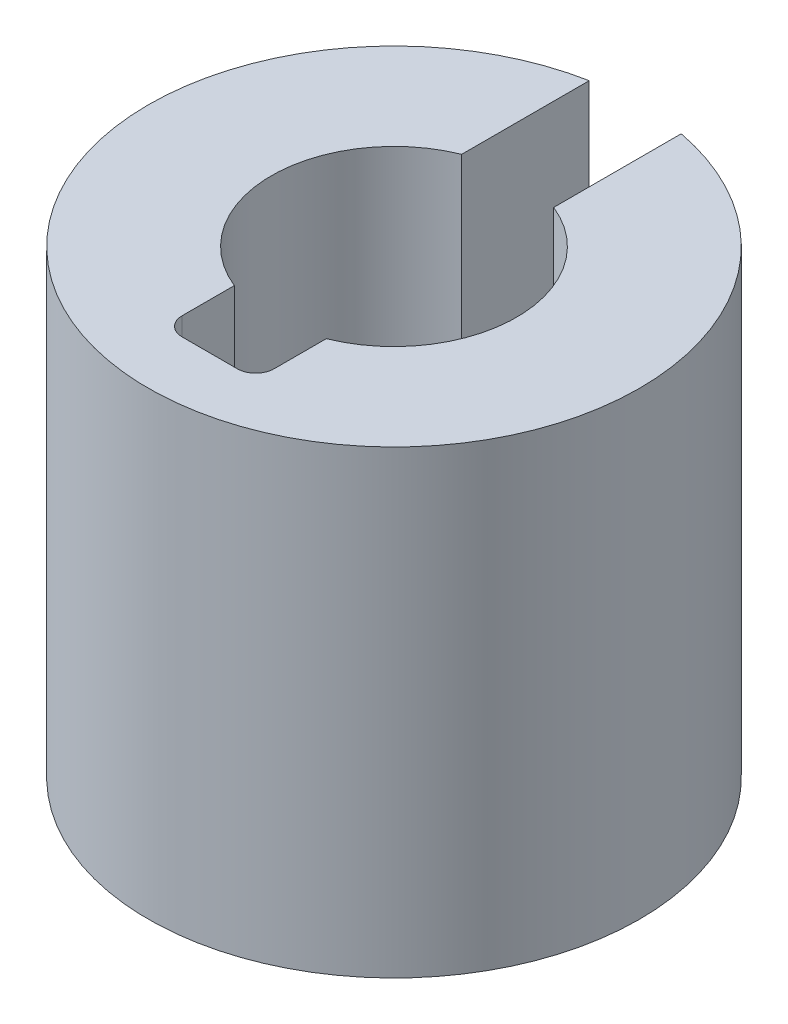
ISO-10303-21;
HEADER;
FILE_DESCRIPTION(('STEP AP214'),'2;1');
FILE_NAME('part.step','',(''),(''),'','','');
FILE_SCHEMA(('AUTOMOTIVE_DESIGN { 1 0 10303 214 1 1 1 1 }'));
ENDSEC;
DATA;
#1=APPLICATION_CONTEXT('core data for automotive mechanical design processes');
#2=APPLICATION_PROTOCOL_DEFINITION('international standard','automotive_design',2000,#1);
#3=PRODUCT_CONTEXT('',#1,'mechanical');
#4=PRODUCT('Part','Part','',(#3));
#5=PRODUCT_RELATED_PRODUCT_CATEGORY('part','',(#4));
#6=PRODUCT_DEFINITION_FORMATION('','',#4);
#7=PRODUCT_DEFINITION_CONTEXT('part definition',#1,'design');
#8=PRODUCT_DEFINITION('design','',#6,#7);
#9=PRODUCT_DEFINITION_SHAPE('','',#8);
#10=(LENGTH_UNIT() NAMED_UNIT(*) SI_UNIT(.MILLI.,.METRE.));
#11=(NAMED_UNIT(*) PLANE_ANGLE_UNIT() SI_UNIT($,.RADIAN.));
#12=(NAMED_UNIT(*) SI_UNIT($,.STERADIAN.) SOLID_ANGLE_UNIT());
#13=UNCERTAINTY_MEASURE_WITH_UNIT(LENGTH_MEASURE(1.E-05),#10,'distance_accuracy_value','');
#14=(GEOMETRIC_REPRESENTATION_CONTEXT(3) GLOBAL_UNCERTAINTY_ASSIGNED_CONTEXT((#13)) GLOBAL_UNIT_ASSIGNED_CONTEXT((#10,
#11,#12)) REPRESENTATION_CONTEXT('',''));
#15=CARTESIAN_POINT('',(0.,0.,0.));
#16=DIRECTION('',(0.,0.,1.));
#17=DIRECTION('',(1.,0.,0.));
#18=AXIS2_PLACEMENT_3D('',#15,#16,#17);
#19=CARTESIAN_POINT('',(-0.75,3.75,3.005));
#20=DIRECTION('',(0.,0.,1.));
#21=DIRECTION('',(1.,0.,0.));
#22=AXIS2_PLACEMENT_3D('',#19,#20,#21);
#23=PLANE('',#22);
#24=DIRECTION('',(0.,1.,0.));
#25=VECTOR('',#24,1.);
#26=CARTESIAN_POINT('',(-0.45,3.75,3.005));
#27=LINE('',#26,#25);
#28=CARTESIAN_POINT('',(-0.45,-3.75,3.005));
#29=VERTEX_POINT('',#28);
#30=CARTESIAN_POINT('',(-0.45,3.75,3.005));
#31=VERTEX_POINT('',#30);
#32=EDGE_CURVE('E134',#29,#31,#27,.T.);
#33=ORIENTED_EDGE('',*,*,#32,.T.);
#34=DIRECTION('',(1.,0.,0.));
#35=VECTOR('',#34,1.);
#36=CARTESIAN_POINT('',(-0.75,3.75,3.005));
#37=LINE('',#36,#35);
#38=CARTESIAN_POINT('',(0.45,3.75,3.005));
#39=VERTEX_POINT('',#38);
#40=EDGE_CURVE('E117',#39,#31,#37,.F.);
#41=ORIENTED_EDGE('',*,*,#40,.F.);
#42=DIRECTION('',(0.,1.,0.));
#43=VECTOR('',#42,1.);
#44=CARTESIAN_POINT('',(0.45,3.75,3.005));
#45=LINE('',#44,#43);
#46=CARTESIAN_POINT('',(0.45,-3.75,3.005));
#47=VERTEX_POINT('',#46);
#48=EDGE_CURVE('E116',#39,#47,#45,.F.);
#49=ORIENTED_EDGE('',*,*,#48,.T.);
#50=DIRECTION('',(1.,0.,0.));
#51=VECTOR('',#50,1.);
#52=CARTESIAN_POINT('',(-0.75,-3.75,3.005));
#53=LINE('',#52,#51);
#54=EDGE_CURVE('E106',#29,#47,#53,.T.);
#55=ORIENTED_EDGE('',*,*,#54,.F.);
#56=EDGE_LOOP('',(#33,#41,#49,#55));
#57=FACE_BOUND('',#56,.T.);
#58=ADVANCED_FACE('F17',(#57),#23,.F.);
#59=CARTESIAN_POINT('',(0.45,3.75,2.705));
#60=DIRECTION('',(0.,1.,0.));
#61=DIRECTION('',(0.,0.,1.));
#62=AXIS2_PLACEMENT_3D('',#59,#60,#61);
#63=CYLINDRICAL_SURFACE('',#62,0.3);
#64=DIRECTION('',(0.,1.,0.));
#65=VECTOR('',#64,1.);
#66=CARTESIAN_POINT('',(0.75,3.75,2.705));
#67=LINE('',#66,#65);
#68=CARTESIAN_POINT('',(0.75,3.75,2.705));
#69=VERTEX_POINT('',#68);
#70=CARTESIAN_POINT('',(0.75,-3.75,2.705));
#71=VERTEX_POINT('',#70);
#72=EDGE_CURVE('E127',#69,#71,#67,.F.);
#73=ORIENTED_EDGE('',*,*,#72,.T.);
#74=CARTESIAN_POINT('',(0.45,-3.75,2.705));
#75=DIRECTION('',(0.,1.,0.));
#76=DIRECTION('',(0.,0.,1.));
#77=AXIS2_PLACEMENT_3D('',#74,#75,#76);
#78=CIRCLE('',#77,0.3);
#79=EDGE_CURVE('E20',#47,#71,#78,.T.);
#80=ORIENTED_EDGE('',*,*,#79,.F.);
#81=ORIENTED_EDGE('',*,*,#48,.F.);
#82=CARTESIAN_POINT('',(0.45,3.75,2.705));
#83=DIRECTION('',(0.,1.,0.));
#84=DIRECTION('',(0.,0.,1.));
#85=AXIS2_PLACEMENT_3D('',#82,#83,#84);
#86=CIRCLE('',#85,0.3);
#87=EDGE_CURVE('E129',#69,#39,#86,.F.);
#88=ORIENTED_EDGE('',*,*,#87,.F.);
#89=EDGE_LOOP('',(#73,#80,#81,#88));
#90=FACE_BOUND('',#89,.T.);
#91=ADVANCED_FACE('F125',(#90),#63,.F.);
#92=CARTESIAN_POINT('',(-0.45,3.75,2.705));
#93=DIRECTION('',(0.,1.,0.));
#94=DIRECTION('',(0.,0.,1.));
#95=AXIS2_PLACEMENT_3D('',#92,#93,#94);
#96=CYLINDRICAL_SURFACE('',#95,0.3);
#97=ORIENTED_EDGE('',*,*,#32,.F.);
#98=CARTESIAN_POINT('',(-0.45,-3.75,2.705));
#99=DIRECTION('',(0.,1.,0.));
#100=DIRECTION('',(0.,0.,1.));
#101=AXIS2_PLACEMENT_3D('',#98,#99,#100);
#102=CIRCLE('',#101,0.3);
#103=CARTESIAN_POINT('',(-0.75,-3.75,2.705));
#104=VERTEX_POINT('',#103);
#105=EDGE_CURVE('E112',#104,#29,#102,.T.);
#106=ORIENTED_EDGE('',*,*,#105,.F.);
#107=DIRECTION('',(0.,1.,0.));
#108=VECTOR('',#107,1.);
#109=CARTESIAN_POINT('',(-0.75,3.75,2.705));
#110=LINE('',#109,#108);
#111=CARTESIAN_POINT('',(-0.75,3.75,2.705));
#112=VERTEX_POINT('',#111);
#113=EDGE_CURVE('E173',#104,#112,#110,.T.);
#114=ORIENTED_EDGE('',*,*,#113,.T.);
#115=CARTESIAN_POINT('',(-0.45,3.75,2.705));
#116=DIRECTION('',(0.,1.,0.));
#117=DIRECTION('',(0.,0.,1.));
#118=AXIS2_PLACEMENT_3D('',#115,#116,#117);
#119=CIRCLE('',#118,0.3);
#120=EDGE_CURVE('E137',#31,#112,#119,.F.);
#121=ORIENTED_EDGE('',*,*,#120,.F.);
#122=EDGE_LOOP('',(#97,#106,#114,#121));
#123=FACE_BOUND('',#122,.T.);
#124=ADVANCED_FACE('F221',(#123),#96,.F.);
#125=CARTESIAN_POINT('',(0.75,3.75,3.005));
#126=DIRECTION('',(1.,0.,0.));
#127=DIRECTION('',(0.,0.,-1.));
#128=AXIS2_PLACEMENT_3D('',#125,#126,#127);
#129=PLANE('',#128);
#130=ORIENTED_EDGE('',*,*,#72,.F.);
#131=DIRECTION('',(0.,0.,-1.));
#132=VECTOR('',#131,1.);
#133=CARTESIAN_POINT('',(0.75,3.75,3.005));
#134=LINE('',#133,#132);
#135=CARTESIAN_POINT('',(0.75,3.75,1.85404962177392));
#136=VERTEX_POINT('',#135);
#137=EDGE_CURVE('E140',#136,#69,#134,.F.);
#138=ORIENTED_EDGE('',*,*,#137,.F.);
#139=DIRECTION('',(0.,-1.,0.));
#140=VECTOR('',#139,1.);
#141=CARTESIAN_POINT('',(0.75,3.75,1.85404962177392));
#142=LINE('',#141,#140);
#143=CARTESIAN_POINT('',(0.75,-3.75,1.85404962177392));
#144=VERTEX_POINT('',#143);
#145=EDGE_CURVE('E184',#136,#144,#142,.T.);
#146=ORIENTED_EDGE('',*,*,#145,.T.);
#147=DIRECTION('',(0.,0.,-1.));
#148=VECTOR('',#147,1.);
#149=CARTESIAN_POINT('',(0.75,-3.75,3.005));
#150=LINE('',#149,#148);
#151=EDGE_CURVE('E172',#71,#144,#150,.T.);
#152=ORIENTED_EDGE('',*,*,#151,.F.);
#153=EDGE_LOOP('',(#130,#138,#146,#152));
#154=FACE_BOUND('',#153,.T.);
#155=ADVANCED_FACE('F218',(#154),#129,.F.);
#156=CARTESIAN_POINT('',(-0.75,3.75,3.005));
#157=DIRECTION('',(-1.,0.,0.));
#158=DIRECTION('',(0.,0.,1.));
#159=AXIS2_PLACEMENT_3D('',#156,#157,#158);
#160=PLANE('',#159);
#161=ORIENTED_EDGE('',*,*,#113,.F.);
#162=DIRECTION('',(0.,0.,1.));
#163=VECTOR('',#162,1.);
#164=CARTESIAN_POINT('',(-0.75,-3.75,3.005));
#165=LINE('',#164,#163);
#166=CARTESIAN_POINT('',(-0.75,-3.75,1.85404962177392));
#167=VERTEX_POINT('',#166);
#168=EDGE_CURVE('E178',#167,#104,#165,.T.);
#169=ORIENTED_EDGE('',*,*,#168,.F.);
#170=DIRECTION('',(0.,-1.,0.));
#171=VECTOR('',#170,1.);
#172=CARTESIAN_POINT('',(-0.749999999999999,3.75,1.85404962177392));
#173=LINE('',#172,#171);
#174=CARTESIAN_POINT('',(-0.75,3.75,1.85404962177392));
#175=VERTEX_POINT('',#174);
#176=EDGE_CURVE('E144',#167,#175,#173,.F.);
#177=ORIENTED_EDGE('',*,*,#176,.T.);
#178=DIRECTION('',(0.,0.,1.));
#179=VECTOR('',#178,1.);
#180=CARTESIAN_POINT('',(-0.75,3.75,3.005));
#181=LINE('',#180,#179);
#182=EDGE_CURVE('E177',#112,#175,#181,.F.);
#183=ORIENTED_EDGE('',*,*,#182,.F.);
#184=EDGE_LOOP('',(#161,#169,#177,#183));
#185=FACE_BOUND('',#184,.T.);
#186=ADVANCED_FACE('F220',(#185),#160,.F.);
#187=CARTESIAN_POINT('',(0.,3.75,0.));
#188=DIRECTION('',(0.,-1.,0.));
#189=DIRECTION('',(0.,0.,-1.));
#190=AXIS2_PLACEMENT_3D('',#187,#188,#189);
#191=CYLINDRICAL_SURFACE('',#190,2.);
#192=ORIENTED_EDGE('',*,*,#145,.F.);
#193=CARTESIAN_POINT('',(0.,3.75,0.));
#194=DIRECTION('',(0.,-1.,0.));
#195=DIRECTION('',(0.,0.,-1.));
#196=AXIS2_PLACEMENT_3D('',#193,#194,#195);
#197=CIRCLE('',#196,2.);
#198=CARTESIAN_POINT('',(0.75,3.75,-1.85404962177392));
#199=VERTEX_POINT('',#198);
#200=EDGE_CURVE('E149',#199,#136,#197,.T.);
#201=ORIENTED_EDGE('',*,*,#200,.F.);
#202=DIRECTION('',(0.,1.,0.));
#203=VECTOR('',#202,1.);
#204=CARTESIAN_POINT('',(0.75,3.75,-1.85404962177392));
#205=LINE('',#204,#203);
#206=CARTESIAN_POINT('',(0.75,-3.75,-1.85404962177392));
#207=VERTEX_POINT('',#206);
#208=EDGE_CURVE('E148',#199,#207,#205,.F.);
#209=ORIENTED_EDGE('',*,*,#208,.T.);
#210=CARTESIAN_POINT('',(0.,-3.75,0.));
#211=DIRECTION('',(0.,-1.,0.));
#212=DIRECTION('',(0.,0.,-1.));
#213=AXIS2_PLACEMENT_3D('',#210,#211,#212);
#214=CIRCLE('',#213,2.);
#215=EDGE_CURVE('E143',#207,#144,#214,.T.);
#216=ORIENTED_EDGE('',*,*,#215,.T.);
#217=EDGE_LOOP('',(#192,#201,#209,#216));
#218=FACE_BOUND('',#217,.T.);
#219=ADVANCED_FACE('F216',(#218),#191,.F.);
#220=CARTESIAN_POINT('',(0.,3.75,0.));
#221=DIRECTION('',(0.,-1.,0.));
#222=DIRECTION('',(0.,0.,-1.));
#223=AXIS2_PLACEMENT_3D('',#220,#221,#222);
#224=CYLINDRICAL_SURFACE('',#223,2.);
#225=DIRECTION('',(0.,1.,0.));
#226=VECTOR('',#225,1.);
#227=CARTESIAN_POINT('',(-0.75,3.75,-1.85404962177392));
#228=LINE('',#227,#226);
#229=CARTESIAN_POINT('',(-0.75,-3.75,-1.85404962177392));
#230=VERTEX_POINT('',#229);
#231=CARTESIAN_POINT('',(-0.75,3.75,-1.85404962177392));
#232=VERTEX_POINT('',#231);
#233=EDGE_CURVE('E193',#230,#232,#228,.T.);
#234=ORIENTED_EDGE('',*,*,#233,.T.);
#235=CARTESIAN_POINT('',(0.,3.75,0.));
#236=DIRECTION('',(0.,-1.,0.));
#237=DIRECTION('',(0.,0.,-1.));
#238=AXIS2_PLACEMENT_3D('',#235,#236,#237);
#239=CIRCLE('',#238,2.);
#240=EDGE_CURVE('E153',#175,#232,#239,.T.);
#241=ORIENTED_EDGE('',*,*,#240,.F.);
#242=ORIENTED_EDGE('',*,*,#176,.F.);
#243=CARTESIAN_POINT('',(0.,-3.75,0.));
#244=DIRECTION('',(0.,-1.,0.));
#245=DIRECTION('',(0.,0.,-1.));
#246=AXIS2_PLACEMENT_3D('',#243,#244,#245);
#247=CIRCLE('',#246,2.);
#248=EDGE_CURVE('E141',#167,#230,#247,.T.);
#249=ORIENTED_EDGE('',*,*,#248,.T.);
#250=EDGE_LOOP('',(#234,#241,#242,#249));
#251=FACE_BOUND('',#250,.T.);
#252=ADVANCED_FACE('F249',(#251),#224,.F.);
#253=CARTESIAN_POINT('',(0.,-3.75,0.));
#254=DIRECTION('',(0.,1.,0.));
#255=DIRECTION('',(0.,0.,1.));
#256=AXIS2_PLACEMENT_3D('',#253,#254,#255);
#257=PLANE('',#256);
#258=DIRECTION('',(0.,0.,-1.));
#259=VECTOR('',#258,1.);
#260=CARTESIAN_POINT('',(0.75,-3.75,-1.85404962177392));
#261=LINE('',#260,#259);
#262=CARTESIAN_POINT('',(0.75,-3.75,-3.9341485737069));
#263=VERTEX_POINT('',#262);
#264=EDGE_CURVE('E154',#207,#263,#261,.T.);
#265=ORIENTED_EDGE('',*,*,#264,.T.);
#266=CARTESIAN_POINT('',(0.,-3.75,0.));
#267=DIRECTION('',(0.,-1.,0.));
#268=DIRECTION('',(0.,0.,-1.));
#269=AXIS2_PLACEMENT_3D('',#266,#267,#268);
#270=CIRCLE('',#269,4.005);
#271=CARTESIAN_POINT('',(-0.75,-3.75,-3.9341485737069));
#272=VERTEX_POINT('',#271);
#273=EDGE_CURVE('E158',#272,#263,#270,.F.);
#274=ORIENTED_EDGE('',*,*,#273,.F.);
#275=DIRECTION('',(0.,0.,1.));
#276=VECTOR('',#275,1.);
#277=CARTESIAN_POINT('',(-0.75,-3.75,-1.85404962177392));
#278=LINE('',#277,#276);
#279=EDGE_CURVE('E163',#272,#230,#278,.T.);
#280=ORIENTED_EDGE('',*,*,#279,.T.);
#281=ORIENTED_EDGE('',*,*,#248,.F.);
#282=ORIENTED_EDGE('',*,*,#168,.T.);
#283=ORIENTED_EDGE('',*,*,#105,.T.);
#284=ORIENTED_EDGE('',*,*,#54,.T.);
#285=ORIENTED_EDGE('',*,*,#79,.T.);
#286=ORIENTED_EDGE('',*,*,#151,.T.);
#287=ORIENTED_EDGE('',*,*,#215,.F.);
#288=EDGE_LOOP('',(#265,#274,#280,#281,#282,#283,#284,#285,#286,#287));
#289=FACE_BOUND('',#288,.T.);
#290=ADVANCED_FACE('F108',(#289),#257,.F.);
#291=CARTESIAN_POINT('',(0.75,3.75,-1.85404962177392));
#292=DIRECTION('',(1.,0.,0.));
#293=DIRECTION('',(0.,0.,-1.));
#294=AXIS2_PLACEMENT_3D('',#291,#292,#293);
#295=PLANE('',#294);
#296=ORIENTED_EDGE('',*,*,#208,.F.);
#297=DIRECTION('',(0.,0.,1.));
#298=VECTOR('',#297,1.);
#299=CARTESIAN_POINT('',(0.75,3.75,0.));
#300=LINE('',#299,#298);
#301=CARTESIAN_POINT('',(0.75,3.75,-3.9341485737069));
#302=VERTEX_POINT('',#301);
#303=EDGE_CURVE('E157',#302,#199,#300,.T.);
#304=ORIENTED_EDGE('',*,*,#303,.F.);
#305=DIRECTION('',(0.,-1.,0.));
#306=VECTOR('',#305,1.);
#307=CARTESIAN_POINT('',(0.75,3.75,-3.9341485737069));
#308=LINE('',#307,#306);
#309=EDGE_CURVE('E162',#263,#302,#308,.F.);
#310=ORIENTED_EDGE('',*,*,#309,.F.);
#311=ORIENTED_EDGE('',*,*,#264,.F.);
#312=EDGE_LOOP('',(#296,#304,#310,#311));
#313=FACE_BOUND('',#312,.T.);
#314=ADVANCED_FACE('F211',(#313),#295,.F.);
#315=CARTESIAN_POINT('',(0.,3.75,0.));
#316=DIRECTION('',(0.,1.,0.));
#317=DIRECTION('',(0.,0.,1.));
#318=AXIS2_PLACEMENT_3D('',#315,#316,#317);
#319=PLANE('',#318);
#320=CARTESIAN_POINT('',(0.,3.75,0.));
#321=DIRECTION('',(0.,-1.,0.));
#322=DIRECTION('',(0.,0.,-1.));
#323=AXIS2_PLACEMENT_3D('',#320,#321,#322);
#324=CIRCLE('',#323,4.005);
#325=CARTESIAN_POINT('',(-0.75,3.75,-3.9341485737069));
#326=VERTEX_POINT('',#325);
#327=EDGE_CURVE('E27',#302,#326,#324,.T.);
#328=ORIENTED_EDGE('',*,*,#327,.F.);
#329=ORIENTED_EDGE('',*,*,#303,.T.);
#330=ORIENTED_EDGE('',*,*,#200,.T.);
#331=ORIENTED_EDGE('',*,*,#137,.T.);
#332=ORIENTED_EDGE('',*,*,#87,.T.);
#333=ORIENTED_EDGE('',*,*,#40,.T.);
#334=ORIENTED_EDGE('',*,*,#120,.T.);
#335=ORIENTED_EDGE('',*,*,#182,.T.);
#336=ORIENTED_EDGE('',*,*,#240,.T.);
#337=DIRECTION('',(0.,0.,1.));
#338=VECTOR('',#337,1.);
#339=CARTESIAN_POINT('',(-0.75,3.75,-1.85404962177392));
#340=LINE('',#339,#338);
#341=EDGE_CURVE('E40',#232,#326,#340,.F.);
#342=ORIENTED_EDGE('',*,*,#341,.T.);
#343=EDGE_LOOP('',(#328,#329,#330,#331,#332,#333,#334,#335,#336,#342));
#344=FACE_BOUND('',#343,.T.);
#345=ADVANCED_FACE('F207',(#344),#319,.T.);
#346=CARTESIAN_POINT('',(-0.75,3.75,-1.85404962177392));
#347=DIRECTION('',(-1.,0.,0.));
#348=DIRECTION('',(0.,0.,1.));
#349=AXIS2_PLACEMENT_3D('',#346,#347,#348);
#350=PLANE('',#349);
#351=DIRECTION('',(0.,-1.,0.));
#352=VECTOR('',#351,1.);
#353=CARTESIAN_POINT('',(-0.75,3.75,-3.9341485737069));
#354=LINE('',#353,#352);
#355=EDGE_CURVE('E11',#326,#272,#354,.T.);
#356=ORIENTED_EDGE('',*,*,#355,.F.);
#357=ORIENTED_EDGE('',*,*,#341,.F.);
#358=ORIENTED_EDGE('',*,*,#233,.F.);
#359=ORIENTED_EDGE('',*,*,#279,.F.);
#360=EDGE_LOOP('',(#356,#357,#358,#359));
#361=FACE_BOUND('',#360,.T.);
#362=ADVANCED_FACE('F234',(#361),#350,.F.);
#363=CARTESIAN_POINT('',(0.,3.75,0.));
#364=DIRECTION('',(0.,-1.,0.));
#365=DIRECTION('',(0.,0.,-1.));
#366=AXIS2_PLACEMENT_3D('',#363,#364,#365);
#367=CYLINDRICAL_SURFACE('',#366,4.005);
#368=ORIENTED_EDGE('',*,*,#327,.T.);
#369=ORIENTED_EDGE('',*,*,#355,.T.);
#370=ORIENTED_EDGE('',*,*,#273,.T.);
#371=ORIENTED_EDGE('',*,*,#309,.T.);
#372=EDGE_LOOP('',(#368,#369,#370,#371));
#373=FACE_BOUND('',#372,.T.);
#374=ADVANCED_FACE('F232',(#373),#367,.T.);
#375=CLOSED_SHELL('',(#58,#91,#124,#155,#186,#219,#252,#290,#314,#345,#362,#374));
#376=MANIFOLD_SOLID_BREP('B1',#375);
#377=ADVANCED_BREP_SHAPE_REPRESENTATION('',(#18,#376),#14);
#378=SHAPE_DEFINITION_REPRESENTATION(#9,#377);
ENDSEC;
END-ISO-10303-21;
